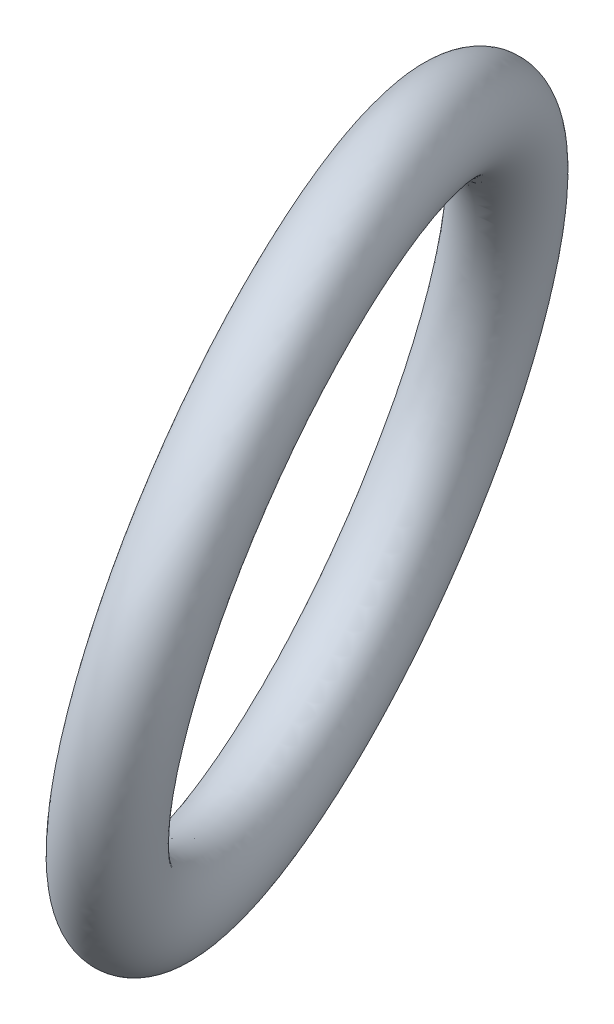
ISO-10303-21;
HEADER;
FILE_DESCRIPTION(('STEP AP214'),'2;1');
FILE_NAME('part.step','',(''),(''),'','','');
FILE_SCHEMA(('AUTOMOTIVE_DESIGN { 1 0 10303 214 1 1 1 1 }'));
ENDSEC;
DATA;
#1=APPLICATION_CONTEXT('core data for automotive mechanical design processes');
#2=APPLICATION_PROTOCOL_DEFINITION('international standard','automotive_design',2000,#1);
#3=PRODUCT_CONTEXT('',#1,'mechanical');
#4=PRODUCT('Part','Part','',(#3));
#5=PRODUCT_RELATED_PRODUCT_CATEGORY('part','',(#4));
#6=PRODUCT_DEFINITION_FORMATION('','',#4);
#7=PRODUCT_DEFINITION_CONTEXT('part definition',#1,'design');
#8=PRODUCT_DEFINITION('design','',#6,#7);
#9=PRODUCT_DEFINITION_SHAPE('','',#8);
#10=(LENGTH_UNIT() NAMED_UNIT(*) SI_UNIT(.MILLI.,.METRE.));
#11=(NAMED_UNIT(*) PLANE_ANGLE_UNIT() SI_UNIT($,.RADIAN.));
#12=(NAMED_UNIT(*) SI_UNIT($,.STERADIAN.) SOLID_ANGLE_UNIT());
#13=UNCERTAINTY_MEASURE_WITH_UNIT(LENGTH_MEASURE(1.E-05),#10,'distance_accuracy_value','');
#14=(GEOMETRIC_REPRESENTATION_CONTEXT(3) GLOBAL_UNCERTAINTY_ASSIGNED_CONTEXT((#13)) GLOBAL_UNIT_ASSIGNED_CONTEXT((#10,
#11,#12)) REPRESENTATION_CONTEXT('',''));
#15=CARTESIAN_POINT('',(0.,0.,0.));
#16=DIRECTION('',(0.,0.,1.));
#17=DIRECTION('',(1.,0.,0.));
#18=AXIS2_PLACEMENT_3D('',#15,#16,#17);
#19=CARTESIAN_POINT('',(-88.5418404071267,153.19519400913,-331.713993695262));
#20=DIRECTION('',(0.,0.866025403784442,-0.499999999999995));
#21=DIRECTION('',(0.387449252410576,0.460945516521874,0.798381054136976));
#22=AXIS2_PLACEMENT_3D('',#19,#20,#21);
#23=ELLIPSE('',#22,35.,31.2622622596183);
#24=CARTESIAN_POINT('',(0.,258.532768172292,-149.26396329861));
#25=DIRECTION('',(-0.921891033043758,0.193724626205286,0.335540895264849));
#26=AXIS1_PLACEMENT('',#24,#25);
#27=SURFACE_OF_REVOLUTION('',#23,#26);
#28=ADVANCED_FACE('F34',(),#27,.T.);
#29=CLOSED_SHELL('',(#28));
#30=MANIFOLD_SOLID_BREP('B2',#29);
#31=ADVANCED_BREP_SHAPE_REPRESENTATION('',(#18,#30),#14);
#32=SHAPE_DEFINITION_REPRESENTATION(#9,#31);
ENDSEC;
END-ISO-10303-21;
